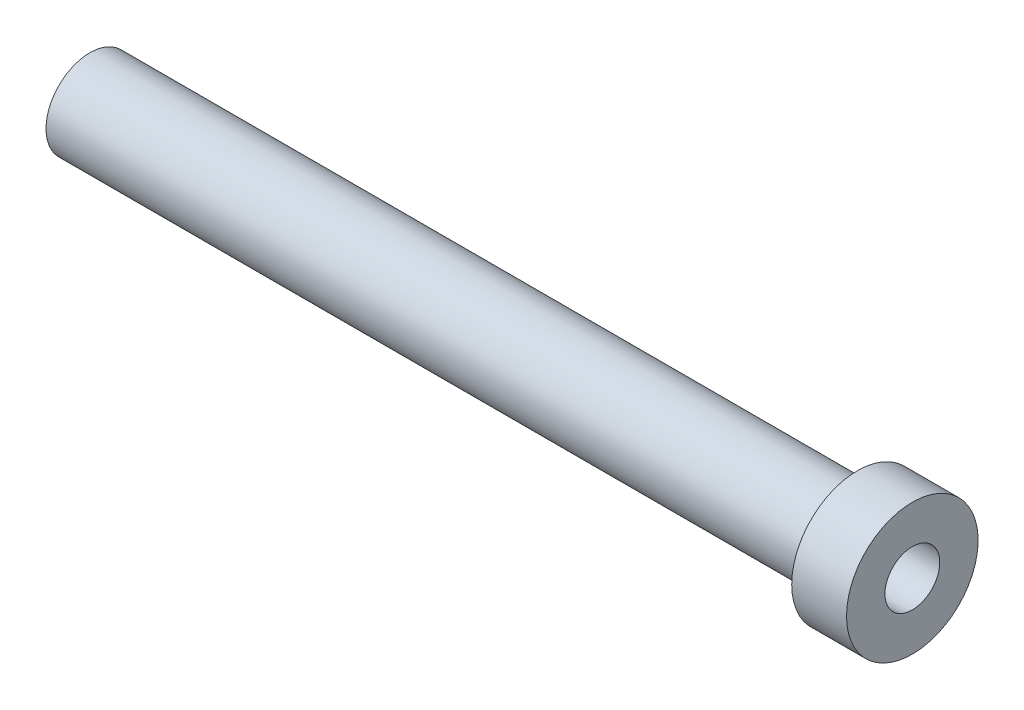
ISO-10303-21;
HEADER;
FILE_DESCRIPTION(('STEP AP214'),'2;1');
FILE_NAME('part.step','',(''),(''),'','','');
FILE_SCHEMA(('AUTOMOTIVE_DESIGN { 1 0 10303 214 1 1 1 1 }'));
ENDSEC;
DATA;
#1=APPLICATION_CONTEXT('core data for automotive mechanical design processes');
#2=APPLICATION_PROTOCOL_DEFINITION('international standard','automotive_design',2000,#1);
#3=PRODUCT_CONTEXT('',#1,'mechanical');
#4=PRODUCT('Part','Part','',(#3));
#5=PRODUCT_RELATED_PRODUCT_CATEGORY('part','',(#4));
#6=PRODUCT_DEFINITION_FORMATION('','',#4);
#7=PRODUCT_DEFINITION_CONTEXT('part definition',#1,'design');
#8=PRODUCT_DEFINITION('design','',#6,#7);
#9=PRODUCT_DEFINITION_SHAPE('','',#8);
#10=(LENGTH_UNIT() NAMED_UNIT(*) SI_UNIT(.MILLI.,.METRE.));
#11=(NAMED_UNIT(*) PLANE_ANGLE_UNIT() SI_UNIT($,.RADIAN.));
#12=(NAMED_UNIT(*) SI_UNIT($,.STERADIAN.) SOLID_ANGLE_UNIT());
#13=UNCERTAINTY_MEASURE_WITH_UNIT(LENGTH_MEASURE(1.E-05),#10,'distance_accuracy_value','');
#14=(GEOMETRIC_REPRESENTATION_CONTEXT(3) GLOBAL_UNCERTAINTY_ASSIGNED_CONTEXT((#13)) GLOBAL_UNIT_ASSIGNED_CONTEXT((#10,
#11,#12)) REPRESENTATION_CONTEXT('',''));
#15=CARTESIAN_POINT('',(0.,0.,0.));
#16=DIRECTION('',(0.,0.,1.));
#17=DIRECTION('',(1.,0.,0.));
#18=AXIS2_PLACEMENT_3D('',#15,#16,#17);
#19=CARTESIAN_POINT('',(6.66118421052632,0.,0.));
#20=DIRECTION('',(1.,0.,0.));
#21=DIRECTION('',(0.,0.,-1.));
#22=AXIS2_PLACEMENT_3D('',#19,#20,#21);
#23=PLANE('',#22);
#24=CARTESIAN_POINT('',(6.66118421052632,0.,0.));
#25=DIRECTION('',(1.,0.,0.));
#26=DIRECTION('',(0.,0.,-1.));
#27=AXIS2_PLACEMENT_3D('',#24,#25,#26);
#28=CIRCLE('',#27,2.5);
#29=CARTESIAN_POINT('',(6.66118421052632,0.,-2.5));
#30=VERTEX_POINT('',#29);
#31=EDGE_CURVE('E52',#30,#30,#28,.T.);
#32=ORIENTED_EDGE('',*,*,#31,.T.);
#33=EDGE_LOOP('',(#32));
#34=FACE_BOUND('',#33,.T.);
#35=CARTESIAN_POINT('',(6.66118421052632,0.,0.));
#36=DIRECTION('',(-1.,0.,0.));
#37=DIRECTION('',(0.,0.,1.));
#38=AXIS2_PLACEMENT_3D('',#35,#36,#37);
#39=CIRCLE('',#38,3.99999999999999);
#40=CARTESIAN_POINT('',(6.66118421052632,0.,3.99999999999999));
#41=VERTEX_POINT('',#40);
#42=EDGE_CURVE('E10',#41,#41,#39,.T.);
#43=ORIENTED_EDGE('',*,*,#42,.T.);
#44=EDGE_LOOP('',(#43));
#45=FACE_BOUND('',#44,.T.);
#46=ADVANCED_FACE('F33',(#34,#45),#23,.F.);
#47=CARTESIAN_POINT('',(0.,0.,0.));
#48=DIRECTION('',(-1.,0.,0.));
#49=DIRECTION('',(0.,0.,1.));
#50=AXIS2_PLACEMENT_3D('',#47,#48,#49);
#51=CYLINDRICAL_SURFACE('',#50,3.99999999999999);
#52=ORIENTED_EDGE('',*,*,#42,.F.);
#53=EDGE_LOOP('',(#52));
#54=FACE_BOUND('',#53,.T.);
#55=CARTESIAN_POINT('',(76.6611842105263,0.,0.));
#56=DIRECTION('',(-1.,0.,0.));
#57=DIRECTION('',(0.,0.,1.));
#58=AXIS2_PLACEMENT_3D('',#55,#56,#57);
#59=CIRCLE('',#58,3.99999999999999);
#60=CARTESIAN_POINT('',(76.6611842105263,0.,3.99999999999999));
#61=VERTEX_POINT('',#60);
#62=EDGE_CURVE('E39',#61,#61,#59,.T.);
#63=ORIENTED_EDGE('',*,*,#62,.T.);
#64=EDGE_LOOP('',(#63));
#65=FACE_BOUND('',#64,.T.);
#66=ADVANCED_FACE('F80',(#54,#65),#51,.T.);
#67=CARTESIAN_POINT('',(76.6611842105263,3.99999999999999,0.));
#68=DIRECTION('',(1.,0.,0.));
#69=DIRECTION('',(0.,0.,-1.));
#70=AXIS2_PLACEMENT_3D('',#67,#68,#69);
#71=PLANE('',#70);
#72=ORIENTED_EDGE('',*,*,#62,.F.);
#73=EDGE_LOOP('',(#72));
#74=FACE_BOUND('',#73,.T.);
#75=CARTESIAN_POINT('',(76.6611842105263,0.,0.));
#76=DIRECTION('',(-1.,0.,0.));
#77=DIRECTION('',(0.,0.,1.));
#78=AXIS2_PLACEMENT_3D('',#75,#76,#77);
#79=CIRCLE('',#78,6.);
#80=CARTESIAN_POINT('',(76.6611842105263,0.,6.));
#81=VERTEX_POINT('',#80);
#82=EDGE_CURVE('E43',#81,#81,#79,.T.);
#83=ORIENTED_EDGE('',*,*,#82,.T.);
#84=EDGE_LOOP('',(#83));
#85=FACE_BOUND('',#84,.T.);
#86=ADVANCED_FACE('F74',(#74,#85),#71,.F.);
#87=CARTESIAN_POINT('',(0.,0.,0.));
#88=DIRECTION('',(-1.,0.,0.));
#89=DIRECTION('',(0.,0.,1.));
#90=AXIS2_PLACEMENT_3D('',#87,#88,#89);
#91=CYLINDRICAL_SURFACE('',#90,6.);
#92=ORIENTED_EDGE('',*,*,#82,.F.);
#93=EDGE_LOOP('',(#92));
#94=FACE_BOUND('',#93,.T.);
#95=CARTESIAN_POINT('',(81.6611842105263,0.,0.));
#96=DIRECTION('',(-1.,0.,0.));
#97=DIRECTION('',(0.,0.,1.));
#98=AXIS2_PLACEMENT_3D('',#95,#96,#97);
#99=CIRCLE('',#98,6.);
#100=CARTESIAN_POINT('',(81.6611842105263,0.,6.));
#101=VERTEX_POINT('',#100);
#102=EDGE_CURVE('E47',#101,#101,#99,.T.);
#103=ORIENTED_EDGE('',*,*,#102,.T.);
#104=EDGE_LOOP('',(#103));
#105=FACE_BOUND('',#104,.T.);
#106=ADVANCED_FACE('F69',(#94,#105),#91,.T.);
#107=CARTESIAN_POINT('',(81.6611842105263,6.,0.));
#108=DIRECTION('',(-1.,0.,0.));
#109=DIRECTION('',(0.,0.,1.));
#110=AXIS2_PLACEMENT_3D('',#107,#108,#109);
#111=PLANE('',#110);
#112=CARTESIAN_POINT('',(81.6611842105263,0.,0.));
#113=DIRECTION('',(1.,0.,0.));
#114=DIRECTION('',(0.,0.,-1.));
#115=AXIS2_PLACEMENT_3D('',#112,#113,#114);
#116=CIRCLE('',#115,2.5);
#117=CARTESIAN_POINT('',(81.6611842105263,0.,-2.5));
#118=VERTEX_POINT('',#117);
#119=EDGE_CURVE('E53',#118,#118,#116,.T.);
#120=ORIENTED_EDGE('',*,*,#119,.F.);
#121=EDGE_LOOP('',(#120));
#122=FACE_BOUND('',#121,.T.);
#123=ORIENTED_EDGE('',*,*,#102,.F.);
#124=EDGE_LOOP('',(#123));
#125=FACE_BOUND('',#124,.T.);
#126=ADVANCED_FACE('F63',(#122,#125),#111,.F.);
#127=CARTESIAN_POINT('',(6.66118421052632,0.,0.));
#128=DIRECTION('',(1.,0.,0.));
#129=DIRECTION('',(0.,0.,-1.));
#130=AXIS2_PLACEMENT_3D('',#127,#128,#129);
#131=CYLINDRICAL_SURFACE('',#130,2.5);
#132=ORIENTED_EDGE('',*,*,#31,.F.);
#133=EDGE_LOOP('',(#132));
#134=FACE_BOUND('',#133,.T.);
#135=ORIENTED_EDGE('',*,*,#119,.T.);
#136=EDGE_LOOP('',(#135));
#137=FACE_BOUND('',#136,.T.);
#138=ADVANCED_FACE('F60',(#134,#137),#131,.F.);
#139=CLOSED_SHELL('',(#46,#66,#86,#106,#126,#138));
#140=MANIFOLD_SOLID_BREP('B2',#139);
#141=ADVANCED_BREP_SHAPE_REPRESENTATION('',(#18,#140),#14);
#142=SHAPE_DEFINITION_REPRESENTATION(#9,#141);
ENDSEC;
END-ISO-10303-21;
